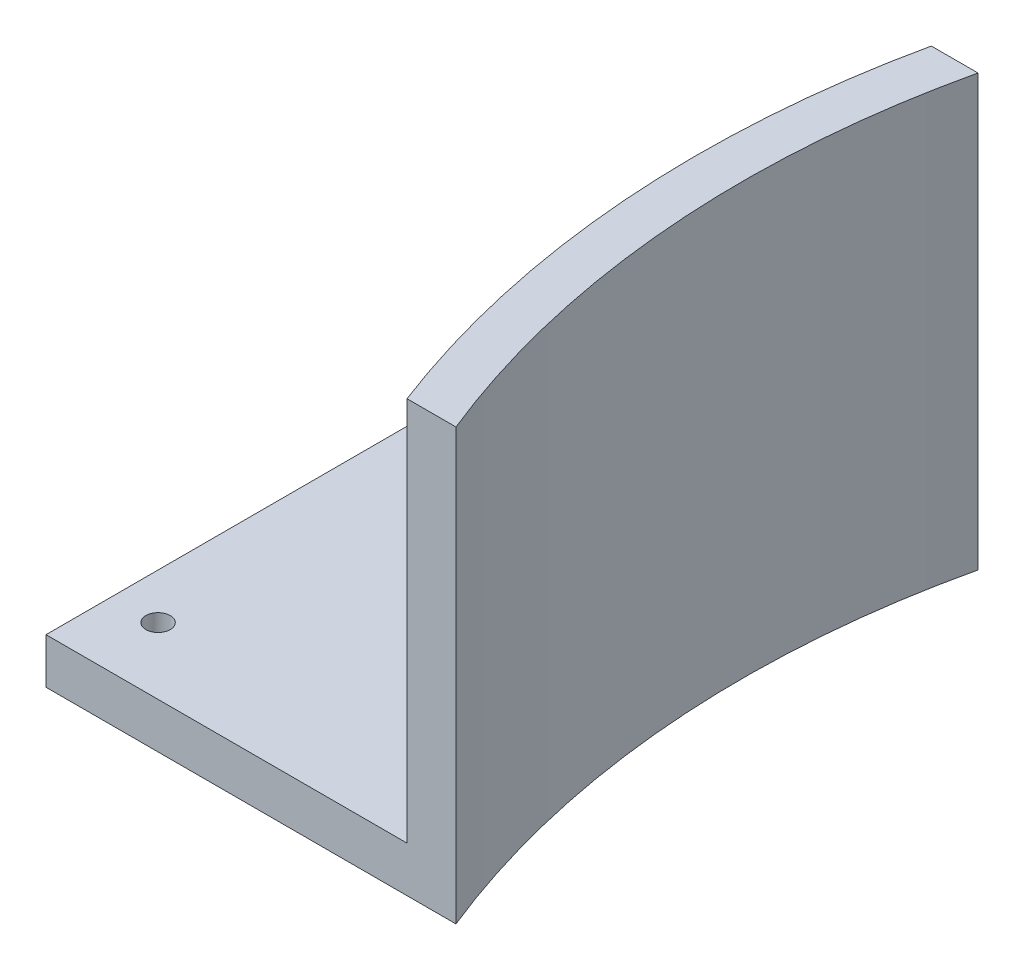
ISO-10303-21;
HEADER;
FILE_DESCRIPTION(('STEP AP214'),'2;1');
FILE_NAME('part.step','',(''),(''),'','','');
FILE_SCHEMA(('AUTOMOTIVE_DESIGN { 1 0 10303 214 1 1 1 1 }'));
ENDSEC;
DATA;
#1=APPLICATION_CONTEXT('core data for automotive mechanical design processes');
#2=APPLICATION_PROTOCOL_DEFINITION('international standard','automotive_design',2000,#1);
#3=PRODUCT_CONTEXT('',#1,'mechanical');
#4=PRODUCT('Part','Part','',(#3));
#5=PRODUCT_RELATED_PRODUCT_CATEGORY('part','',(#4));
#6=PRODUCT_DEFINITION_FORMATION('','',#4);
#7=PRODUCT_DEFINITION_CONTEXT('part definition',#1,'design');
#8=PRODUCT_DEFINITION('design','',#6,#7);
#9=PRODUCT_DEFINITION_SHAPE('','',#8);
#10=(LENGTH_UNIT() NAMED_UNIT(*) SI_UNIT(.MILLI.,.METRE.));
#11=(NAMED_UNIT(*) PLANE_ANGLE_UNIT() SI_UNIT($,.RADIAN.));
#12=(NAMED_UNIT(*) SI_UNIT($,.STERADIAN.) SOLID_ANGLE_UNIT());
#13=UNCERTAINTY_MEASURE_WITH_UNIT(LENGTH_MEASURE(1.E-05),#10,'distance_accuracy_value','');
#14=(GEOMETRIC_REPRESENTATION_CONTEXT(3) GLOBAL_UNCERTAINTY_ASSIGNED_CONTEXT((#13)) GLOBAL_UNIT_ASSIGNED_CONTEXT((#10,
#11,#12)) REPRESENTATION_CONTEXT('',''));
#15=CARTESIAN_POINT('',(0.,0.,0.));
#16=DIRECTION('',(0.,0.,1.));
#17=DIRECTION('',(1.,0.,0.));
#18=AXIS2_PLACEMENT_3D('',#15,#16,#17);
#19=CARTESIAN_POINT('',(50.8,59.999999888,-79.121));
#20=DIRECTION('',(0.,0.,1.));
#21=DIRECTION('',(1.,0.,0.));
#22=AXIS2_PLACEMENT_3D('',#19,#20,#21);
#23=PLANE('',#22);
#24=DIRECTION('',(0.,1.,0.));
#25=VECTOR('',#24,1.);
#26=CARTESIAN_POINT('',(44.2934515267819,-96.2892494846341,-79.121));
#27=LINE('',#26,#25);
#28=CARTESIAN_POINT('',(44.2934515267819,6.34999999999999,-79.121));
#29=VERTEX_POINT('',#28);
#30=CARTESIAN_POINT('',(44.2934515267819,59.999999888,-79.121));
#31=VERTEX_POINT('',#30);
#32=EDGE_CURVE('E123',#29,#31,#27,.T.);
#33=ORIENTED_EDGE('',*,*,#32,.T.);
#34=DIRECTION('',(-1.,0.,0.));
#35=VECTOR('',#34,1.);
#36=CARTESIAN_POINT('',(50.8,59.999999888,-79.121));
#37=LINE('',#36,#35);
#38=CARTESIAN_POINT('',(50.8,59.999999888,-79.121));
#39=VERTEX_POINT('',#38);
#40=EDGE_CURVE('E119',#39,#31,#37,.T.);
#41=ORIENTED_EDGE('',*,*,#40,.F.);
#42=DIRECTION('',(0.,-1.,0.));
#43=VECTOR('',#42,1.);
#44=CARTESIAN_POINT('',(50.8,59.999999888,-79.121));
#45=LINE('',#44,#43);
#46=CARTESIAN_POINT('',(50.8,0.,-79.121));
#47=VERTEX_POINT('',#46);
#48=EDGE_CURVE('E47',#39,#47,#45,.T.);
#49=ORIENTED_EDGE('',*,*,#48,.T.);
#50=DIRECTION('',(-1.,0.,0.));
#51=VECTOR('',#50,1.);
#52=CARTESIAN_POINT('',(50.8,0.,-79.121));
#53=LINE('',#52,#51);
#54=CARTESIAN_POINT('',(0.,0.,-79.121));
#55=VERTEX_POINT('',#54);
#56=EDGE_CURVE('E103',#47,#55,#53,.T.);
#57=ORIENTED_EDGE('',*,*,#56,.T.);
#58=DIRECTION('',(0.,-1.,0.));
#59=VECTOR('',#58,1.);
#60=CARTESIAN_POINT('',(0.,59.999999888,-79.121));
#61=LINE('',#60,#59);
#62=CARTESIAN_POINT('',(0.,6.34999999999999,-79.121));
#63=VERTEX_POINT('',#62);
#64=EDGE_CURVE('E114',#63,#55,#61,.T.);
#65=ORIENTED_EDGE('',*,*,#64,.F.);
#66=DIRECTION('',(-1.,0.,0.));
#67=VECTOR('',#66,1.);
#68=CARTESIAN_POINT('',(179.547471402223,6.34999999999999,-79.121));
#69=LINE('',#68,#67);
#70=EDGE_CURVE('E127',#29,#63,#69,.T.);
#71=ORIENTED_EDGE('',*,*,#70,.F.);
#72=EDGE_LOOP('',(#33,#41,#49,#57,#65,#71));
#73=FACE_BOUND('',#72,.T.);
#74=ADVANCED_FACE('F39',(#73),#23,.F.);
#75=CARTESIAN_POINT('',(0.,59.999999888,-79.121));
#76=DIRECTION('',(1.,0.,0.));
#77=DIRECTION('',(0.,0.,-1.));
#78=AXIS2_PLACEMENT_3D('',#75,#76,#77);
#79=PLANE('',#78);
#80=DIRECTION('',(0.,0.,1.));
#81=VECTOR('',#80,1.);
#82=CARTESIAN_POINT('',(0.,6.34999999999999,-49.6385474640628));
#83=LINE('',#82,#81);
#84=CARTESIAN_POINT('',(0.,6.34999999999999,0.));
#85=VERTEX_POINT('',#84);
#86=EDGE_CURVE('E130',#63,#85,#83,.T.);
#87=ORIENTED_EDGE('',*,*,#86,.F.);
#88=ORIENTED_EDGE('',*,*,#64,.T.);
#89=DIRECTION('',(0.,0.,1.));
#90=VECTOR('',#89,1.);
#91=CARTESIAN_POINT('',(0.,0.,-79.121));
#92=LINE('',#91,#90);
#93=CARTESIAN_POINT('',(0.,0.,0.));
#94=VERTEX_POINT('',#93);
#95=EDGE_CURVE('E94',#55,#94,#92,.T.);
#96=ORIENTED_EDGE('',*,*,#95,.T.);
#97=DIRECTION('',(0.,-1.,0.));
#98=VECTOR('',#97,1.);
#99=CARTESIAN_POINT('',(0.,59.999999888,0.));
#100=LINE('',#99,#98);
#101=EDGE_CURVE('E88',#85,#94,#100,.T.);
#102=ORIENTED_EDGE('',*,*,#101,.F.);
#103=EDGE_LOOP('',(#87,#88,#96,#102));
#104=FACE_BOUND('',#103,.T.);
#105=ADVANCED_FACE('F174',(#104),#79,.F.);
#106=CARTESIAN_POINT('',(0.,59.999999888,0.));
#107=DIRECTION('',(0.,0.,-1.));
#108=DIRECTION('',(-1.,0.,0.));
#109=AXIS2_PLACEMENT_3D('',#106,#107,#108);
#110=PLANE('',#109);
#111=DIRECTION('',(0.,1.,0.));
#112=VECTOR('',#111,1.);
#113=CARTESIAN_POINT('',(50.3233269645136,-96.2892494846341,0.));
#114=LINE('',#113,#112);
#115=CARTESIAN_POINT('',(50.3233269645136,6.34999999999999,0.));
#116=VERTEX_POINT('',#115);
#117=CARTESIAN_POINT('',(50.3233269645136,59.999999888,0.));
#118=VERTEX_POINT('',#117);
#119=EDGE_CURVE('E54',#116,#118,#114,.T.);
#120=ORIENTED_EDGE('',*,*,#119,.F.);
#121=DIRECTION('',(1.,0.,0.));
#122=VECTOR('',#121,1.);
#123=CARTESIAN_POINT('',(0.,6.35,0.));
#124=LINE('',#123,#122);
#125=EDGE_CURVE('E12',#85,#116,#124,.T.);
#126=ORIENTED_EDGE('',*,*,#125,.F.);
#127=ORIENTED_EDGE('',*,*,#101,.T.);
#128=DIRECTION('',(1.,0.,0.));
#129=VECTOR('',#128,1.);
#130=CARTESIAN_POINT('',(0.,0.,0.));
#131=LINE('',#130,#129);
#132=CARTESIAN_POINT('',(57.15,0.,0.));
#133=VERTEX_POINT('',#132);
#134=EDGE_CURVE('E81',#94,#133,#131,.T.);
#135=ORIENTED_EDGE('',*,*,#134,.T.);
#136=DIRECTION('',(0.,-1.,0.));
#137=VECTOR('',#136,1.);
#138=CARTESIAN_POINT('',(57.15,59.999999888,0.));
#139=LINE('',#138,#137);
#140=CARTESIAN_POINT('',(57.15,59.999999888,0.));
#141=VERTEX_POINT('',#140);
#142=EDGE_CURVE('E84',#141,#133,#139,.T.);
#143=ORIENTED_EDGE('',*,*,#142,.F.);
#144=DIRECTION('',(1.,0.,0.));
#145=VECTOR('',#144,1.);
#146=CARTESIAN_POINT('',(0.,59.999999888,0.));
#147=LINE('',#146,#145);
#148=EDGE_CURVE('E62',#118,#141,#147,.T.);
#149=ORIENTED_EDGE('',*,*,#148,.F.);
#150=EDGE_LOOP('',(#120,#126,#127,#135,#143,#149));
#151=FACE_BOUND('',#150,.T.);
#152=ADVANCED_FACE('F83',(#151),#110,.F.);
#153=CARTESIAN_POINT('',(179.547471402223,59.999999888,-49.6385474640628));
#154=DIRECTION('',(0.,1.,0.));
#155=DIRECTION('',(0.,0.,1.));
#156=AXIS2_PLACEMENT_3D('',#153,#154,#155);
#157=PLANE('',#156);
#158=ORIENTED_EDGE('',*,*,#40,.T.);
#159=CARTESIAN_POINT('',(179.547471402223,59.999999888,-49.6385474640628));
#160=DIRECTION('',(0.,1.,0.));
#161=DIRECTION('',(0.,0.,1.));
#162=AXIS2_PLACEMENT_3D('',#159,#160,#161);
#163=CIRCLE('',#162,138.43);
#164=EDGE_CURVE('E132',#31,#118,#163,.T.);
#165=ORIENTED_EDGE('',*,*,#164,.T.);
#166=ORIENTED_EDGE('',*,*,#148,.T.);
#167=CARTESIAN_POINT('',(179.547471402223,59.999999888,-49.6385474640628));
#168=DIRECTION('',(0.,-1.,0.));
#169=DIRECTION('',(0.,0.,1.));
#170=AXIS2_PLACEMENT_3D('',#167,#168,#169);
#171=CIRCLE('',#170,132.08);
#172=EDGE_CURVE('E93',#141,#39,#171,.T.);
#173=ORIENTED_EDGE('',*,*,#172,.T.);
#174=EDGE_LOOP('',(#158,#165,#166,#173));
#175=FACE_BOUND('',#174,.T.);
#176=ADVANCED_FACE('F124',(#175),#157,.T.);
#177=CARTESIAN_POINT('',(179.547471402223,59.999999888,-49.6385474640628));
#178=DIRECTION('',(0.,-1.,0.));
#179=DIRECTION('',(0.,0.,-1.));
#180=AXIS2_PLACEMENT_3D('',#177,#178,#179);
#181=CYLINDRICAL_SURFACE('',#180,132.08);
#182=CARTESIAN_POINT('',(179.547471402223,0.,-49.6385474640628));
#183=DIRECTION('',(0.,-1.,0.));
#184=DIRECTION('',(0.,0.,1.));
#185=AXIS2_PLACEMENT_3D('',#182,#183,#184);
#186=CIRCLE('',#185,132.08);
#187=EDGE_CURVE('E99',#133,#47,#186,.T.);
#188=ORIENTED_EDGE('',*,*,#187,.T.);
#189=ORIENTED_EDGE('',*,*,#48,.F.);
#190=ORIENTED_EDGE('',*,*,#172,.F.);
#191=ORIENTED_EDGE('',*,*,#142,.T.);
#192=EDGE_LOOP('',(#188,#189,#190,#191));
#193=FACE_BOUND('',#192,.T.);
#194=ADVANCED_FACE('F41',(#193),#181,.F.);
#195=CARTESIAN_POINT('',(179.547471402223,0.,-49.6385474640628));
#196=DIRECTION('',(0.,1.,0.));
#197=DIRECTION('',(0.,0.,1.));
#198=AXIS2_PLACEMENT_3D('',#195,#196,#197);
#199=PLANE('',#198);
#200=CARTESIAN_POINT('',(6.35000000000066,0.,-9.27100000000002));
#201=DIRECTION('',(0.,1.,0.));
#202=DIRECTION('',(0.,0.,1.));
#203=AXIS2_PLACEMENT_3D('',#200,#201,#202);
#204=CIRCLE('',#203,1.700000029);
#205=CARTESIAN_POINT('',(6.35000000000066,0.,-7.57099997100002));
#206=VERTEX_POINT('',#205);
#207=EDGE_CURVE('E145',#206,#206,#204,.T.);
#208=ORIENTED_EDGE('',*,*,#207,.T.);
#209=EDGE_LOOP('',(#208));
#210=FACE_BOUND('',#209,.T.);
#211=CARTESIAN_POINT('',(25.4,0.,-72.771));
#212=DIRECTION('',(0.,1.,0.));
#213=DIRECTION('',(0.,0.,1.));
#214=AXIS2_PLACEMENT_3D('',#211,#212,#213);
#215=CIRCLE('',#214,1.700000029);
#216=CARTESIAN_POINT('',(25.4,0.,-71.070999971));
#217=VERTEX_POINT('',#216);
#218=EDGE_CURVE('E151',#217,#217,#215,.T.);
#219=ORIENTED_EDGE('',*,*,#218,.T.);
#220=EDGE_LOOP('',(#219));
#221=FACE_BOUND('',#220,.T.);
#222=CARTESIAN_POINT('',(6.35,0.,-72.771));
#223=DIRECTION('',(0.,1.,0.));
#224=DIRECTION('',(0.,0.,1.));
#225=AXIS2_PLACEMENT_3D('',#222,#223,#224);
#226=CIRCLE('',#225,1.700000029);
#227=CARTESIAN_POINT('',(6.35,0.,-71.070999971));
#228=VERTEX_POINT('',#227);
#229=EDGE_CURVE('E134',#228,#228,#226,.T.);
#230=ORIENTED_EDGE('',*,*,#229,.T.);
#231=EDGE_LOOP('',(#230));
#232=FACE_BOUND('',#231,.T.);
#233=ORIENTED_EDGE('',*,*,#187,.F.);
#234=ORIENTED_EDGE('',*,*,#134,.F.);
#235=ORIENTED_EDGE('',*,*,#95,.F.);
#236=ORIENTED_EDGE('',*,*,#56,.F.);
#237=EDGE_LOOP('',(#233,#234,#235,#236));
#238=FACE_BOUND('',#237,.T.);
#239=ADVANCED_FACE('F101',(#210,#221,#232,#238),#199,.F.);
#240=CARTESIAN_POINT('',(179.547471402223,6.35,-49.6385474640628));
#241=DIRECTION('',(0.,1.,0.));
#242=DIRECTION('',(0.,0.,1.));
#243=AXIS2_PLACEMENT_3D('',#240,#241,#242);
#244=PLANE('',#243);
#245=CARTESIAN_POINT('',(6.35000000000066,6.35,-9.27100000000002));
#246=DIRECTION('',(0.,1.,0.));
#247=DIRECTION('',(0.,0.,1.));
#248=AXIS2_PLACEMENT_3D('',#245,#246,#247);
#249=CIRCLE('',#248,1.700000029);
#250=CARTESIAN_POINT('',(6.35000000000066,6.35,-7.57099997100002));
#251=VERTEX_POINT('',#250);
#252=EDGE_CURVE('E148',#251,#251,#249,.T.);
#253=ORIENTED_EDGE('',*,*,#252,.F.);
#254=EDGE_LOOP('',(#253));
#255=FACE_BOUND('',#254,.T.);
#256=CARTESIAN_POINT('',(25.4,6.35,-72.771));
#257=DIRECTION('',(0.,1.,0.));
#258=DIRECTION('',(0.,0.,1.));
#259=AXIS2_PLACEMENT_3D('',#256,#257,#258);
#260=CIRCLE('',#259,1.700000029);
#261=CARTESIAN_POINT('',(25.4,6.35,-71.070999971));
#262=VERTEX_POINT('',#261);
#263=EDGE_CURVE('E142',#262,#262,#260,.T.);
#264=ORIENTED_EDGE('',*,*,#263,.F.);
#265=EDGE_LOOP('',(#264));
#266=FACE_BOUND('',#265,.T.);
#267=CARTESIAN_POINT('',(6.35,6.35,-72.771));
#268=DIRECTION('',(0.,1.,0.));
#269=DIRECTION('',(0.,0.,1.));
#270=AXIS2_PLACEMENT_3D('',#267,#268,#269);
#271=CIRCLE('',#270,1.700000029);
#272=CARTESIAN_POINT('',(6.35,6.35,-71.070999971));
#273=VERTEX_POINT('',#272);
#274=EDGE_CURVE('E139',#273,#273,#271,.T.);
#275=ORIENTED_EDGE('',*,*,#274,.F.);
#276=EDGE_LOOP('',(#275));
#277=FACE_BOUND('',#276,.T.);
#278=ORIENTED_EDGE('',*,*,#125,.T.);
#279=CARTESIAN_POINT('',(179.547471402223,6.34999999999999,-49.6385474640628));
#280=DIRECTION('',(0.,1.,0.));
#281=DIRECTION('',(0.,0.,1.));
#282=AXIS2_PLACEMENT_3D('',#279,#280,#281);
#283=CIRCLE('',#282,138.43);
#284=EDGE_CURVE('E107',#116,#29,#283,.F.);
#285=ORIENTED_EDGE('',*,*,#284,.T.);
#286=ORIENTED_EDGE('',*,*,#70,.T.);
#287=ORIENTED_EDGE('',*,*,#86,.T.);
#288=EDGE_LOOP('',(#278,#285,#286,#287));
#289=FACE_BOUND('',#288,.T.);
#290=ADVANCED_FACE('F159',(#255,#266,#277,#289),#244,.T.);
#291=CARTESIAN_POINT('',(179.547471402223,-96.2892494846341,-49.6385474640628));
#292=DIRECTION('',(0.,1.,0.));
#293=DIRECTION('',(0.,0.,1.));
#294=AXIS2_PLACEMENT_3D('',#291,#292,#293);
#295=CYLINDRICAL_SURFACE('',#294,138.43);
#296=ORIENTED_EDGE('',*,*,#119,.T.);
#297=ORIENTED_EDGE('',*,*,#164,.F.);
#298=ORIENTED_EDGE('',*,*,#32,.F.);
#299=ORIENTED_EDGE('',*,*,#284,.F.);
#300=EDGE_LOOP('',(#296,#297,#298,#299));
#301=FACE_BOUND('',#300,.T.);
#302=ADVANCED_FACE('F162',(#301),#295,.T.);
#303=CARTESIAN_POINT('',(6.35,0.,-72.771));
#304=DIRECTION('',(0.,1.,0.));
#305=DIRECTION('',(0.,0.,1.));
#306=AXIS2_PLACEMENT_3D('',#303,#304,#305);
#307=CYLINDRICAL_SURFACE('',#306,1.700000029);
#308=ORIENTED_EDGE('',*,*,#229,.F.);
#309=EDGE_LOOP('',(#308));
#310=FACE_BOUND('',#309,.T.);
#311=ORIENTED_EDGE('',*,*,#274,.T.);
#312=EDGE_LOOP('',(#311));
#313=FACE_BOUND('',#312,.T.);
#314=ADVANCED_FACE('F191',(#310,#313),#307,.F.);
#315=CARTESIAN_POINT('',(25.4,0.,-72.771));
#316=DIRECTION('',(0.,1.,0.));
#317=DIRECTION('',(0.,0.,1.));
#318=AXIS2_PLACEMENT_3D('',#315,#316,#317);
#319=CYLINDRICAL_SURFACE('',#318,1.700000029);
#320=ORIENTED_EDGE('',*,*,#218,.F.);
#321=EDGE_LOOP('',(#320));
#322=FACE_BOUND('',#321,.T.);
#323=ORIENTED_EDGE('',*,*,#263,.T.);
#324=EDGE_LOOP('',(#323));
#325=FACE_BOUND('',#324,.T.);
#326=ADVANCED_FACE('F157',(#322,#325),#319,.F.);
#327=CARTESIAN_POINT('',(6.35000000000066,0.,-9.27100000000002));
#328=DIRECTION('',(0.,1.,0.));
#329=DIRECTION('',(0.,0.,1.));
#330=AXIS2_PLACEMENT_3D('',#327,#328,#329);
#331=CYLINDRICAL_SURFACE('',#330,1.700000029);
#332=ORIENTED_EDGE('',*,*,#207,.F.);
#333=EDGE_LOOP('',(#332));
#334=FACE_BOUND('',#333,.T.);
#335=ORIENTED_EDGE('',*,*,#252,.T.);
#336=EDGE_LOOP('',(#335));
#337=FACE_BOUND('',#336,.T.);
#338=ADVANCED_FACE('F196',(#334,#337),#331,.F.);
#339=CLOSED_SHELL('',(#74,#105,#152,#176,#194,#239,#290,#302,#314,#326,#338));
#340=MANIFOLD_SOLID_BREP('B2',#339);
#341=ADVANCED_BREP_SHAPE_REPRESENTATION('',(#18,#340),#14);
#342=SHAPE_DEFINITION_REPRESENTATION(#9,#341);
ENDSEC;
END-ISO-10303-21;
